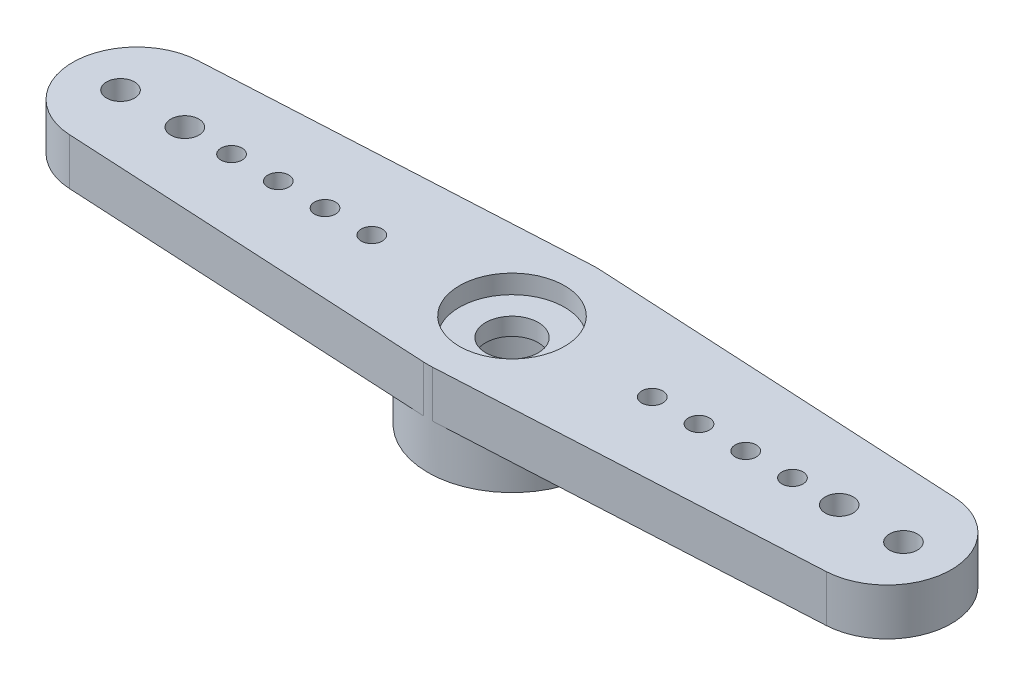
ISO-10303-21;
HEADER;
FILE_DESCRIPTION(('STEP AP214'),'2;1');
FILE_NAME('part.step','',(''),(''),'','','');
FILE_SCHEMA(('AUTOMOTIVE_DESIGN { 1 0 10303 214 1 1 1 1 }'));
ENDSEC;
DATA;
#1=APPLICATION_CONTEXT('core data for automotive mechanical design processes');
#2=APPLICATION_PROTOCOL_DEFINITION('international standard','automotive_design',2000,#1);
#3=PRODUCT_CONTEXT('',#1,'mechanical');
#4=PRODUCT('Part','Part','',(#3));
#5=PRODUCT_RELATED_PRODUCT_CATEGORY('part','',(#4));
#6=PRODUCT_DEFINITION_FORMATION('','',#4);
#7=PRODUCT_DEFINITION_CONTEXT('part definition',#1,'design');
#8=PRODUCT_DEFINITION('design','',#6,#7);
#9=PRODUCT_DEFINITION_SHAPE('','',#8);
#10=(LENGTH_UNIT() NAMED_UNIT(*) SI_UNIT(.MILLI.,.METRE.));
#11=(NAMED_UNIT(*) PLANE_ANGLE_UNIT() SI_UNIT($,.RADIAN.));
#12=(NAMED_UNIT(*) SI_UNIT($,.STERADIAN.) SOLID_ANGLE_UNIT());
#13=UNCERTAINTY_MEASURE_WITH_UNIT(LENGTH_MEASURE(1.E-05),#10,'distance_accuracy_value','');
#14=(GEOMETRIC_REPRESENTATION_CONTEXT(3) GLOBAL_UNCERTAINTY_ASSIGNED_CONTEXT((#13)) GLOBAL_UNIT_ASSIGNED_CONTEXT((#10,
#11,#12)) REPRESENTATION_CONTEXT('',''));
#15=CARTESIAN_POINT('',(0.,0.,0.));
#16=DIRECTION('',(0.,0.,1.));
#17=DIRECTION('',(1.,0.,0.));
#18=AXIS2_PLACEMENT_3D('',#15,#16,#17);
#19=CARTESIAN_POINT('',(0.,55.,0.));
#20=DIRECTION('',(0.,1.,0.));
#21=DIRECTION('',(0.,0.,1.));
#22=AXIS2_PLACEMENT_3D('',#19,#20,#21);
#23=CYLINDRICAL_SURFACE('',#22,3.6);
#24=CARTESIAN_POINT('',(0.,-2.,0.));
#25=DIRECTION('',(0.,1.,0.));
#26=DIRECTION('',(0.,0.,1.));
#27=AXIS2_PLACEMENT_3D('',#24,#25,#26);
#28=CIRCLE('',#27,3.6);
#29=CARTESIAN_POINT('',(0.,-2.,3.6));
#30=VERTEX_POINT('',#29);
#31=EDGE_CURVE('E122',#30,#30,#28,.T.);
#32=ORIENTED_EDGE('',*,*,#31,.T.);
#33=EDGE_LOOP('',(#32));
#34=FACE_BOUND('',#33,.T.);
#35=CARTESIAN_POINT('',(0.,0.,0.));
#36=DIRECTION('',(0.,1.,0.));
#37=DIRECTION('',(0.,0.,1.));
#38=AXIS2_PLACEMENT_3D('',#35,#36,#37);
#39=CIRCLE('',#38,3.6);
#40=CARTESIAN_POINT('',(0.190654205607477,0.,3.59494797930154));
#41=VERTEX_POINT('',#40);
#42=CARTESIAN_POINT('',(0.190654205607477,0.,-3.59494797930153));
#43=VERTEX_POINT('',#42);
#44=EDGE_CURVE('E11',#41,#43,#39,.T.);
#45=ORIENTED_EDGE('',*,*,#44,.F.);
#46=DIRECTION('',(0.,-1.,0.));
#47=VECTOR('',#46,1.);
#48=CARTESIAN_POINT('',(0.190654205607477,40.2831555648173,3.59494797930154));
#49=LINE('',#48,#47);
#50=CARTESIAN_POINT('',(0.190654205607477,2.,3.59494797930154));
#51=VERTEX_POINT('',#50);
#52=EDGE_CURVE('E164',#51,#41,#49,.T.);
#53=ORIENTED_EDGE('',*,*,#52,.F.);
#54=CARTESIAN_POINT('',(0.,2.,0.));
#55=DIRECTION('',(0.,1.,0.));
#56=DIRECTION('',(0.,0.,1.));
#57=AXIS2_PLACEMENT_3D('',#54,#55,#56);
#58=CIRCLE('',#57,3.6);
#59=CARTESIAN_POINT('',(-0.190654205607477,2.,3.59494797930153));
#60=VERTEX_POINT('',#59);
#61=EDGE_CURVE('E123',#60,#51,#58,.T.);
#62=ORIENTED_EDGE('',*,*,#61,.F.);
#63=DIRECTION('',(0.,-1.,0.));
#64=VECTOR('',#63,1.);
#65=CARTESIAN_POINT('',(-0.190654205607478,40.2831555648173,3.59494797930153));
#66=LINE('',#65,#64);
#67=CARTESIAN_POINT('',(-0.190654205607478,0.,3.59494797930153));
#68=VERTEX_POINT('',#67);
#69=EDGE_CURVE('E49',#60,#68,#66,.T.);
#70=ORIENTED_EDGE('',*,*,#69,.T.);
#71=CARTESIAN_POINT('',(-0.190654205607477,0.,-3.59494797930153));
#72=VERTEX_POINT('',#71);
#73=EDGE_CURVE('E42',#72,#68,#39,.T.);
#74=ORIENTED_EDGE('',*,*,#73,.F.);
#75=DIRECTION('',(0.,-1.,0.));
#76=VECTOR('',#75,1.);
#77=CARTESIAN_POINT('',(-0.190654205607477,40.2831555648173,-3.59494797930153));
#78=LINE('',#77,#76);
#79=CARTESIAN_POINT('',(-0.190654205607477,2.,-3.59494797930153));
#80=VERTEX_POINT('',#79);
#81=EDGE_CURVE('E105',#80,#72,#78,.T.);
#82=ORIENTED_EDGE('',*,*,#81,.F.);
#83=CARTESIAN_POINT('',(0.190654205607477,2.,-3.59494797930153));
#84=VERTEX_POINT('',#83);
#85=EDGE_CURVE('E116',#84,#80,#58,.T.);
#86=ORIENTED_EDGE('',*,*,#85,.F.);
#87=DIRECTION('',(0.,-1.,0.));
#88=VECTOR('',#87,1.);
#89=CARTESIAN_POINT('',(0.190654205607477,40.2831555648173,-3.59494797930153));
#90=LINE('',#89,#88);
#91=EDGE_CURVE('E57',#84,#43,#90,.T.);
#92=ORIENTED_EDGE('',*,*,#91,.T.);
#93=EDGE_LOOP('',(#45,#53,#62,#70,#74,#82,#86,#92));
#94=FACE_BOUND('',#93,.T.);
#95=ADVANCED_FACE('F34',(#34,#94),#23,.T.);
#96=CARTESIAN_POINT('',(3.6,2.,0.));
#97=DIRECTION('',(0.,-1.,0.));
#98=DIRECTION('',(0.,0.,-1.));
#99=AXIS2_PLACEMENT_3D('',#96,#97,#98);
#100=PLANE('',#99);
#101=CARTESIAN_POINT('',(0.,2.,0.));
#102=DIRECTION('',(0.,1.,0.));
#103=DIRECTION('',(0.,0.,1.));
#104=AXIS2_PLACEMENT_3D('',#101,#102,#103);
#105=CIRCLE('',#104,2.25);
#106=CARTESIAN_POINT('',(0.,2.,2.25));
#107=VERTEX_POINT('',#106);
#108=EDGE_CURVE('E146',#107,#107,#105,.T.);
#109=ORIENTED_EDGE('',*,*,#108,.F.);
#110=EDGE_LOOP('',(#109));
#111=FACE_BOUND('',#110,.T.);
#112=ORIENTED_EDGE('',*,*,#61,.T.);
#113=DIRECTION('',(-0.998596660917093,0.,0.0529595015576324));
#114=VECTOR('',#113,1.);
#115=CARTESIAN_POINT('',(0.190654205607477,2.,3.59494797930154));
#116=LINE('',#115,#114);
#117=CARTESIAN_POINT('',(16.1956386292835,2.,2.74614081752201));
#118=VERTEX_POINT('',#117);
#119=EDGE_CURVE('E162',#118,#51,#116,.T.);
#120=ORIENTED_EDGE('',*,*,#119,.F.);
#121=CARTESIAN_POINT('',(16.05,2.,0.));
#122=DIRECTION('',(0.,-1.,0.));
#123=DIRECTION('',(0.,0.,-1.));
#124=AXIS2_PLACEMENT_3D('',#121,#122,#123);
#125=CIRCLE('',#124,2.75);
#126=CARTESIAN_POINT('',(16.1956386292835,2.,-2.74614081752201));
#127=VERTEX_POINT('',#126);
#128=EDGE_CURVE('E174',#127,#118,#125,.T.);
#129=ORIENTED_EDGE('',*,*,#128,.F.);
#130=DIRECTION('',(0.998596660917093,0.,0.0529595015576324));
#131=VECTOR('',#130,1.);
#132=CARTESIAN_POINT('',(16.1956386292835,2.,-2.74614081752201));
#133=LINE('',#132,#131);
#134=EDGE_CURVE('E121',#84,#127,#133,.T.);
#135=ORIENTED_EDGE('',*,*,#134,.F.);
#136=ORIENTED_EDGE('',*,*,#85,.T.);
#137=DIRECTION('',(0.998596660917093,0.,-0.0529595015576324));
#138=VECTOR('',#137,1.);
#139=CARTESIAN_POINT('',(-0.190654205607477,2.,-3.59494797930153));
#140=LINE('',#139,#138);
#141=CARTESIAN_POINT('',(-16.1956386292835,2.,-2.74614081752201));
#142=VERTEX_POINT('',#141);
#143=EDGE_CURVE('E101',#142,#80,#140,.T.);
#144=ORIENTED_EDGE('',*,*,#143,.F.);
#145=CARTESIAN_POINT('',(-16.05,2.,0.));
#146=DIRECTION('',(0.,-1.,0.));
#147=DIRECTION('',(0.,0.,-1.));
#148=AXIS2_PLACEMENT_3D('',#145,#146,#147);
#149=CIRCLE('',#148,2.75);
#150=CARTESIAN_POINT('',(-16.1956386292835,2.,2.74614081752201));
#151=VERTEX_POINT('',#150);
#152=EDGE_CURVE('E180',#151,#142,#149,.T.);
#153=ORIENTED_EDGE('',*,*,#152,.F.);
#154=DIRECTION('',(-0.998596660917093,0.,-0.0529595015576324));
#155=VECTOR('',#154,1.);
#156=CARTESIAN_POINT('',(-16.1956386292835,2.,2.74614081752201));
#157=LINE('',#156,#155);
#158=EDGE_CURVE('E182',#60,#151,#157,.T.);
#159=ORIENTED_EDGE('',*,*,#158,.F.);
#160=EDGE_LOOP('',(#112,#120,#129,#135,#136,#144,#153,#159));
#161=FACE_BOUND('',#160,.T.);
#162=CARTESIAN_POINT('',(-16.75,2.,0.));
#163=DIRECTION('',(0.,-1.,0.));
#164=DIRECTION('',(0.,0.,-1.));
#165=AXIS2_PLACEMENT_3D('',#162,#163,#164);
#166=CIRCLE('',#165,0.6);
#167=CARTESIAN_POINT('',(-16.75,2.,-0.6));
#168=VERTEX_POINT('',#167);
#169=EDGE_CURVE('E128',#168,#168,#166,.T.);
#170=ORIENTED_EDGE('',*,*,#169,.T.);
#171=EDGE_LOOP('',(#170));
#172=FACE_BOUND('',#171,.T.);
#173=CARTESIAN_POINT('',(-14.,2.,0.));
#174=DIRECTION('',(0.,-1.,0.));
#175=DIRECTION('',(0.,0.,-1.));
#176=AXIS2_PLACEMENT_3D('',#173,#174,#175);
#177=CIRCLE('',#176,0.6);
#178=CARTESIAN_POINT('',(-14.,2.,-0.6));
#179=VERTEX_POINT('',#178);
#180=EDGE_CURVE('E190',#179,#179,#177,.T.);
#181=ORIENTED_EDGE('',*,*,#180,.T.);
#182=EDGE_LOOP('',(#181));
#183=FACE_BOUND('',#182,.T.);
#184=CARTESIAN_POINT('',(-12.,2.,0.));
#185=DIRECTION('',(0.,-1.,0.));
#186=DIRECTION('',(0.,0.,-1.));
#187=AXIS2_PLACEMENT_3D('',#184,#185,#186);
#188=CIRCLE('',#187,0.45);
#189=CARTESIAN_POINT('',(-12.,2.,-0.45));
#190=VERTEX_POINT('',#189);
#191=EDGE_CURVE('E196',#190,#190,#188,.T.);
#192=ORIENTED_EDGE('',*,*,#191,.T.);
#193=EDGE_LOOP('',(#192));
#194=FACE_BOUND('',#193,.T.);
#195=CARTESIAN_POINT('',(-10.,2.,0.));
#196=DIRECTION('',(0.,-1.,0.));
#197=DIRECTION('',(0.,0.,-1.));
#198=AXIS2_PLACEMENT_3D('',#195,#196,#197);
#199=CIRCLE('',#198,0.45);
#200=CARTESIAN_POINT('',(-10.,2.,-0.45));
#201=VERTEX_POINT('',#200);
#202=EDGE_CURVE('E199',#201,#201,#199,.T.);
#203=ORIENTED_EDGE('',*,*,#202,.T.);
#204=EDGE_LOOP('',(#203));
#205=FACE_BOUND('',#204,.T.);
#206=CARTESIAN_POINT('',(-8.,2.,0.));
#207=DIRECTION('',(0.,-1.,0.));
#208=DIRECTION('',(0.,0.,-1.));
#209=AXIS2_PLACEMENT_3D('',#206,#207,#208);
#210=CIRCLE('',#209,0.45);
#211=CARTESIAN_POINT('',(-8.,2.,-0.45));
#212=VERTEX_POINT('',#211);
#213=EDGE_CURVE('E202',#212,#212,#210,.T.);
#214=ORIENTED_EDGE('',*,*,#213,.T.);
#215=EDGE_LOOP('',(#214));
#216=FACE_BOUND('',#215,.T.);
#217=CARTESIAN_POINT('',(-6.,2.,0.));
#218=DIRECTION('',(0.,-1.,0.));
#219=DIRECTION('',(0.,0.,-1.));
#220=AXIS2_PLACEMENT_3D('',#217,#218,#219);
#221=CIRCLE('',#220,0.45);
#222=CARTESIAN_POINT('',(-6.,2.,-0.45));
#223=VERTEX_POINT('',#222);
#224=EDGE_CURVE('E205',#223,#223,#221,.T.);
#225=ORIENTED_EDGE('',*,*,#224,.T.);
#226=EDGE_LOOP('',(#225));
#227=FACE_BOUND('',#226,.T.);
#228=CARTESIAN_POINT('',(16.75,2.,0.));
#229=DIRECTION('',(0.,-1.,0.));
#230=DIRECTION('',(0.,0.,-1.));
#231=AXIS2_PLACEMENT_3D('',#228,#229,#230);
#232=CIRCLE('',#231,0.6);
#233=CARTESIAN_POINT('',(16.75,2.,-0.6));
#234=VERTEX_POINT('',#233);
#235=EDGE_CURVE('E187',#234,#234,#232,.T.);
#236=ORIENTED_EDGE('',*,*,#235,.T.);
#237=EDGE_LOOP('',(#236));
#238=FACE_BOUND('',#237,.T.);
#239=CARTESIAN_POINT('',(14.,2.,0.));
#240=DIRECTION('',(0.,-1.,0.));
#241=DIRECTION('',(0.,0.,-1.));
#242=AXIS2_PLACEMENT_3D('',#239,#240,#241);
#243=CIRCLE('',#242,0.6);
#244=CARTESIAN_POINT('',(14.,2.,-0.6));
#245=VERTEX_POINT('',#244);
#246=EDGE_CURVE('E193',#245,#245,#243,.T.);
#247=ORIENTED_EDGE('',*,*,#246,.T.);
#248=EDGE_LOOP('',(#247));
#249=FACE_BOUND('',#248,.T.);
#250=CARTESIAN_POINT('',(6.,2.,0.));
#251=DIRECTION('',(0.,-1.,0.));
#252=DIRECTION('',(0.,0.,-1.));
#253=AXIS2_PLACEMENT_3D('',#250,#251,#252);
#254=CIRCLE('',#253,0.45);
#255=CARTESIAN_POINT('',(6.,2.,-0.45));
#256=VERTEX_POINT('',#255);
#257=EDGE_CURVE('E208',#256,#256,#254,.T.);
#258=ORIENTED_EDGE('',*,*,#257,.T.);
#259=EDGE_LOOP('',(#258));
#260=FACE_BOUND('',#259,.T.);
#261=CARTESIAN_POINT('',(8.,2.,0.));
#262=DIRECTION('',(0.,-1.,0.));
#263=DIRECTION('',(0.,0.,-1.));
#264=AXIS2_PLACEMENT_3D('',#261,#262,#263);
#265=CIRCLE('',#264,0.45);
#266=CARTESIAN_POINT('',(8.,2.,-0.45));
#267=VERTEX_POINT('',#266);
#268=EDGE_CURVE('E211',#267,#267,#265,.T.);
#269=ORIENTED_EDGE('',*,*,#268,.T.);
#270=EDGE_LOOP('',(#269));
#271=FACE_BOUND('',#270,.T.);
#272=CARTESIAN_POINT('',(10.,2.,0.));
#273=DIRECTION('',(0.,-1.,0.));
#274=DIRECTION('',(0.,0.,-1.));
#275=AXIS2_PLACEMENT_3D('',#272,#273,#274);
#276=CIRCLE('',#275,0.45);
#277=CARTESIAN_POINT('',(10.,2.,-0.45));
#278=VERTEX_POINT('',#277);
#279=EDGE_CURVE('E213',#278,#278,#276,.T.);
#280=ORIENTED_EDGE('',*,*,#279,.T.);
#281=EDGE_LOOP('',(#280));
#282=FACE_BOUND('',#281,.T.);
#283=CARTESIAN_POINT('',(12.,2.,0.));
#284=DIRECTION('',(0.,-1.,0.));
#285=DIRECTION('',(0.,0.,-1.));
#286=AXIS2_PLACEMENT_3D('',#283,#284,#285);
#287=CIRCLE('',#286,0.45);
#288=CARTESIAN_POINT('',(12.,2.,-0.45));
#289=VERTEX_POINT('',#288);
#290=EDGE_CURVE('E130',#289,#289,#287,.T.);
#291=ORIENTED_EDGE('',*,*,#290,.T.);
#292=EDGE_LOOP('',(#291));
#293=FACE_BOUND('',#292,.T.);
#294=ADVANCED_FACE('F36',(#111,#161,#172,#183,#194,#205,#216,#227,#238,#249,#260,#271,#282,
#293),#100,.F.);
#295=CARTESIAN_POINT('',(0.,55.,0.));
#296=DIRECTION('',(0.,1.,0.));
#297=DIRECTION('',(0.,0.,1.));
#298=AXIS2_PLACEMENT_3D('',#295,#296,#297);
#299=CYLINDRICAL_SURFACE('',#298,2.25);
#300=CARTESIAN_POINT('',(0.,1.2,0.));
#301=DIRECTION('',(0.,1.,0.));
#302=DIRECTION('',(0.,0.,1.));
#303=AXIS2_PLACEMENT_3D('',#300,#301,#302);
#304=CIRCLE('',#303,2.25);
#305=CARTESIAN_POINT('',(0.,1.2,2.25));
#306=VERTEX_POINT('',#305);
#307=EDGE_CURVE('E144',#306,#306,#304,.T.);
#308=ORIENTED_EDGE('',*,*,#307,.F.);
#309=EDGE_LOOP('',(#308));
#310=FACE_BOUND('',#309,.T.);
#311=ORIENTED_EDGE('',*,*,#108,.T.);
#312=EDGE_LOOP('',(#311));
#313=FACE_BOUND('',#312,.T.);
#314=ADVANCED_FACE('F295',(#310,#313),#299,.F.);
#315=CARTESIAN_POINT('',(2.25,1.2,0.));
#316=DIRECTION('',(0.,-1.,0.));
#317=DIRECTION('',(0.,0.,-1.));
#318=AXIS2_PLACEMENT_3D('',#315,#316,#317);
#319=PLANE('',#318);
#320=CARTESIAN_POINT('',(0.,1.2,0.));
#321=DIRECTION('',(0.,1.,0.));
#322=DIRECTION('',(0.,0.,1.));
#323=AXIS2_PLACEMENT_3D('',#320,#321,#322);
#324=CIRCLE('',#323,1.125);
#325=CARTESIAN_POINT('',(0.,1.2,1.125));
#326=VERTEX_POINT('',#325);
#327=EDGE_CURVE('E141',#326,#326,#324,.T.);
#328=ORIENTED_EDGE('',*,*,#327,.F.);
#329=EDGE_LOOP('',(#328));
#330=FACE_BOUND('',#329,.T.);
#331=ORIENTED_EDGE('',*,*,#307,.T.);
#332=EDGE_LOOP('',(#331));
#333=FACE_BOUND('',#332,.T.);
#334=ADVANCED_FACE('F316',(#330,#333),#319,.F.);
#335=CARTESIAN_POINT('',(0.,55.,0.));
#336=DIRECTION('',(0.,1.,0.));
#337=DIRECTION('',(0.,0.,1.));
#338=AXIS2_PLACEMENT_3D('',#335,#336,#337);
#339=CYLINDRICAL_SURFACE('',#338,1.125);
#340=CARTESIAN_POINT('',(0.,0.449999999999999,0.));
#341=DIRECTION('',(0.,1.,0.));
#342=DIRECTION('',(0.,0.,1.));
#343=AXIS2_PLACEMENT_3D('',#340,#341,#342);
#344=CIRCLE('',#343,1.125);
#345=CARTESIAN_POINT('',(0.,0.449999999999999,1.125));
#346=VERTEX_POINT('',#345);
#347=EDGE_CURVE('E138',#346,#346,#344,.T.);
#348=ORIENTED_EDGE('',*,*,#347,.F.);
#349=EDGE_LOOP('',(#348));
#350=FACE_BOUND('',#349,.T.);
#351=ORIENTED_EDGE('',*,*,#327,.T.);
#352=EDGE_LOOP('',(#351));
#353=FACE_BOUND('',#352,.T.);
#354=ADVANCED_FACE('F312',(#350,#353),#339,.F.);
#355=CARTESIAN_POINT('',(1.125,0.45,0.));
#356=DIRECTION('',(0.,1.,0.));
#357=DIRECTION('',(0.,0.,1.));
#358=AXIS2_PLACEMENT_3D('',#355,#356,#357);
#359=PLANE('',#358);
#360=CARTESIAN_POINT('',(0.,0.449999999999999,0.));
#361=DIRECTION('',(0.,1.,0.));
#362=DIRECTION('',(0.,0.,1.));
#363=AXIS2_PLACEMENT_3D('',#360,#361,#362);
#364=CIRCLE('',#363,2.425);
#365=CARTESIAN_POINT('',(0.,0.449999999999999,2.425));
#366=VERTEX_POINT('',#365);
#367=EDGE_CURVE('E135',#366,#366,#364,.T.);
#368=ORIENTED_EDGE('',*,*,#367,.F.);
#369=EDGE_LOOP('',(#368));
#370=FACE_BOUND('',#369,.T.);
#371=ORIENTED_EDGE('',*,*,#347,.T.);
#372=EDGE_LOOP('',(#371));
#373=FACE_BOUND('',#372,.T.);
#374=ADVANCED_FACE('F308',(#370,#373),#359,.F.);
#375=CARTESIAN_POINT('',(0.,55.,0.));
#376=DIRECTION('',(0.,1.,0.));
#377=DIRECTION('',(0.,0.,1.));
#378=AXIS2_PLACEMENT_3D('',#375,#376,#377);
#379=CYLINDRICAL_SURFACE('',#378,2.425);
#380=ORIENTED_EDGE('',*,*,#367,.T.);
#381=EDGE_LOOP('',(#380));
#382=FACE_BOUND('',#381,.T.);
#383=CARTESIAN_POINT('',(0.,-2.,0.));
#384=DIRECTION('',(0.,1.,0.));
#385=DIRECTION('',(0.,0.,1.));
#386=AXIS2_PLACEMENT_3D('',#383,#384,#385);
#387=CIRCLE('',#386,2.425);
#388=CARTESIAN_POINT('',(0.,-2.,2.425));
#389=VERTEX_POINT('',#388);
#390=EDGE_CURVE('E126',#389,#389,#387,.T.);
#391=ORIENTED_EDGE('',*,*,#390,.F.);
#392=EDGE_LOOP('',(#391));
#393=FACE_BOUND('',#392,.T.);
#394=ADVANCED_FACE('F304',(#382,#393),#379,.F.);
#395=CARTESIAN_POINT('',(2.425,-2.,0.));
#396=DIRECTION('',(0.,1.,0.));
#397=DIRECTION('',(0.,0.,1.));
#398=AXIS2_PLACEMENT_3D('',#395,#396,#397);
#399=PLANE('',#398);
#400=ORIENTED_EDGE('',*,*,#31,.F.);
#401=EDGE_LOOP('',(#400));
#402=FACE_BOUND('',#401,.T.);
#403=ORIENTED_EDGE('',*,*,#390,.T.);
#404=EDGE_LOOP('',(#403));
#405=FACE_BOUND('',#404,.T.);
#406=ADVANCED_FACE('F301',(#402,#405),#399,.F.);
#407=CARTESIAN_POINT('',(-16.05,40.2831555648173,0.));
#408=DIRECTION('',(0.,-1.,0.));
#409=DIRECTION('',(0.,0.,-1.));
#410=AXIS2_PLACEMENT_3D('',#407,#408,#409);
#411=CYLINDRICAL_SURFACE('',#410,2.75);
#412=DIRECTION('',(0.,-1.,0.));
#413=VECTOR('',#412,1.);
#414=CARTESIAN_POINT('',(-16.1956386292835,40.2831555648173,2.74614081752201));
#415=LINE('',#414,#413);
#416=CARTESIAN_POINT('',(-16.1956386292835,0.,2.74614081752201));
#417=VERTEX_POINT('',#416);
#418=EDGE_CURVE('E157',#151,#417,#415,.T.);
#419=ORIENTED_EDGE('',*,*,#418,.F.);
#420=ORIENTED_EDGE('',*,*,#152,.T.);
#421=DIRECTION('',(0.,-1.,0.));
#422=VECTOR('',#421,1.);
#423=CARTESIAN_POINT('',(-16.1956386292835,40.2831555648173,-2.74614081752201));
#424=LINE('',#423,#422);
#425=CARTESIAN_POINT('',(-16.1956386292835,0.,-2.74614081752201));
#426=VERTEX_POINT('',#425);
#427=EDGE_CURVE('E107',#142,#426,#424,.T.);
#428=ORIENTED_EDGE('',*,*,#427,.T.);
#429=CARTESIAN_POINT('',(-16.05,0.,0.));
#430=DIRECTION('',(0.,1.,0.));
#431=DIRECTION('',(0.,0.,1.));
#432=AXIS2_PLACEMENT_3D('',#429,#430,#431);
#433=CIRCLE('',#432,2.75);
#434=EDGE_CURVE('E183',#426,#417,#433,.T.);
#435=ORIENTED_EDGE('',*,*,#434,.T.);
#436=EDGE_LOOP('',(#419,#420,#428,#435));
#437=FACE_BOUND('',#436,.T.);
#438=ADVANCED_FACE('F270',(#437),#411,.T.);
#439=CARTESIAN_POINT('',(-6.,40.2831555648173,0.));
#440=DIRECTION('',(0.,-1.,0.));
#441=DIRECTION('',(0.,0.,-1.));
#442=AXIS2_PLACEMENT_3D('',#439,#440,#441);
#443=CYLINDRICAL_SURFACE('',#442,0.45);
#444=ORIENTED_EDGE('',*,*,#224,.F.);
#445=EDGE_LOOP('',(#444));
#446=FACE_BOUND('',#445,.T.);
#447=CARTESIAN_POINT('',(-6.,0.,0.));
#448=DIRECTION('',(0.,1.,0.));
#449=DIRECTION('',(0.,0.,1.));
#450=AXIS2_PLACEMENT_3D('',#447,#448,#449);
#451=CIRCLE('',#450,0.45);
#452=CARTESIAN_POINT('',(-6.,0.,0.45));
#453=VERTEX_POINT('',#452);
#454=EDGE_CURVE('E252',#453,#453,#451,.T.);
#455=ORIENTED_EDGE('',*,*,#454,.F.);
#456=EDGE_LOOP('',(#455));
#457=FACE_BOUND('',#456,.T.);
#458=ADVANCED_FACE('F354',(#446,#457),#443,.F.);
#459=CARTESIAN_POINT('',(-8.,40.2831555648173,0.));
#460=DIRECTION('',(0.,-1.,0.));
#461=DIRECTION('',(0.,0.,-1.));
#462=AXIS2_PLACEMENT_3D('',#459,#460,#461);
#463=CYLINDRICAL_SURFACE('',#462,0.45);
#464=ORIENTED_EDGE('',*,*,#213,.F.);
#465=EDGE_LOOP('',(#464));
#466=FACE_BOUND('',#465,.T.);
#467=CARTESIAN_POINT('',(-8.,0.,0.));
#468=DIRECTION('',(0.,1.,0.));
#469=DIRECTION('',(0.,0.,1.));
#470=AXIS2_PLACEMENT_3D('',#467,#468,#469);
#471=CIRCLE('',#470,0.45);
#472=CARTESIAN_POINT('',(-8.,0.,0.45));
#473=VERTEX_POINT('',#472);
#474=EDGE_CURVE('E249',#473,#473,#471,.T.);
#475=ORIENTED_EDGE('',*,*,#474,.F.);
#476=EDGE_LOOP('',(#475));
#477=FACE_BOUND('',#476,.T.);
#478=ADVANCED_FACE('F361',(#466,#477),#463,.F.);
#479=CARTESIAN_POINT('',(-10.,40.2831555648173,0.));
#480=DIRECTION('',(0.,-1.,0.));
#481=DIRECTION('',(0.,0.,-1.));
#482=AXIS2_PLACEMENT_3D('',#479,#480,#481);
#483=CYLINDRICAL_SURFACE('',#482,0.45);
#484=ORIENTED_EDGE('',*,*,#202,.F.);
#485=EDGE_LOOP('',(#484));
#486=FACE_BOUND('',#485,.T.);
#487=CARTESIAN_POINT('',(-10.,0.,0.));
#488=DIRECTION('',(0.,1.,0.));
#489=DIRECTION('',(0.,0.,1.));
#490=AXIS2_PLACEMENT_3D('',#487,#488,#489);
#491=CIRCLE('',#490,0.45);
#492=CARTESIAN_POINT('',(-10.,0.,0.45));
#493=VERTEX_POINT('',#492);
#494=EDGE_CURVE('E246',#493,#493,#491,.T.);
#495=ORIENTED_EDGE('',*,*,#494,.F.);
#496=EDGE_LOOP('',(#495));
#497=FACE_BOUND('',#496,.T.);
#498=ADVANCED_FACE('F369',(#486,#497),#483,.F.);
#499=CARTESIAN_POINT('',(-12.,40.2831555648173,0.));
#500=DIRECTION('',(0.,-1.,0.));
#501=DIRECTION('',(0.,0.,-1.));
#502=AXIS2_PLACEMENT_3D('',#499,#500,#501);
#503=CYLINDRICAL_SURFACE('',#502,0.45);
#504=ORIENTED_EDGE('',*,*,#191,.F.);
#505=EDGE_LOOP('',(#504));
#506=FACE_BOUND('',#505,.T.);
#507=CARTESIAN_POINT('',(-12.,0.,0.));
#508=DIRECTION('',(0.,1.,0.));
#509=DIRECTION('',(0.,0.,1.));
#510=AXIS2_PLACEMENT_3D('',#507,#508,#509);
#511=CIRCLE('',#510,0.45);
#512=CARTESIAN_POINT('',(-12.,0.,0.45));
#513=VERTEX_POINT('',#512);
#514=EDGE_CURVE('E243',#513,#513,#511,.T.);
#515=ORIENTED_EDGE('',*,*,#514,.F.);
#516=EDGE_LOOP('',(#515));
#517=FACE_BOUND('',#516,.T.);
#518=ADVANCED_FACE('F377',(#506,#517),#503,.F.);
#519=CARTESIAN_POINT('',(-14.,40.2831555648173,0.));
#520=DIRECTION('',(0.,-1.,0.));
#521=DIRECTION('',(0.,0.,-1.));
#522=AXIS2_PLACEMENT_3D('',#519,#520,#521);
#523=CYLINDRICAL_SURFACE('',#522,0.6);
#524=ORIENTED_EDGE('',*,*,#180,.F.);
#525=EDGE_LOOP('',(#524));
#526=FACE_BOUND('',#525,.T.);
#527=CARTESIAN_POINT('',(-14.,0.,0.));
#528=DIRECTION('',(0.,1.,0.));
#529=DIRECTION('',(0.,0.,1.));
#530=AXIS2_PLACEMENT_3D('',#527,#528,#529);
#531=CIRCLE('',#530,0.6);
#532=CARTESIAN_POINT('',(-14.,0.,0.6));
#533=VERTEX_POINT('',#532);
#534=EDGE_CURVE('E236',#533,#533,#531,.T.);
#535=ORIENTED_EDGE('',*,*,#534,.F.);
#536=EDGE_LOOP('',(#535));
#537=FACE_BOUND('',#536,.T.);
#538=ADVANCED_FACE('F385',(#526,#537),#523,.F.);
#539=CARTESIAN_POINT('',(-16.75,40.2831555648173,0.));
#540=DIRECTION('',(0.,-1.,0.));
#541=DIRECTION('',(0.,0.,-1.));
#542=AXIS2_PLACEMENT_3D('',#539,#540,#541);
#543=CYLINDRICAL_SURFACE('',#542,0.6);
#544=ORIENTED_EDGE('',*,*,#169,.F.);
#545=EDGE_LOOP('',(#544));
#546=FACE_BOUND('',#545,.T.);
#547=CARTESIAN_POINT('',(-16.75,0.,0.));
#548=DIRECTION('',(0.,1.,0.));
#549=DIRECTION('',(0.,0.,1.));
#550=AXIS2_PLACEMENT_3D('',#547,#548,#549);
#551=CIRCLE('',#550,0.6);
#552=CARTESIAN_POINT('',(-16.75,0.,0.6));
#553=VERTEX_POINT('',#552);
#554=EDGE_CURVE('E233',#553,#553,#551,.T.);
#555=ORIENTED_EDGE('',*,*,#554,.F.);
#556=EDGE_LOOP('',(#555));
#557=FACE_BOUND('',#556,.T.);
#558=ADVANCED_FACE('F393',(#546,#557),#543,.F.);
#559=CARTESIAN_POINT('',(-16.1956386292835,40.2831555648173,2.74614081752201));
#560=DIRECTION('',(0.0529595015576324,0.,-0.998596660917093));
#561=DIRECTION('',(-0.998596660917093,0.,-0.0529595015576324));
#562=AXIS2_PLACEMENT_3D('',#559,#560,#561);
#563=PLANE('',#562);
#564=ORIENTED_EDGE('',*,*,#69,.F.);
#565=ORIENTED_EDGE('',*,*,#158,.T.);
#566=ORIENTED_EDGE('',*,*,#418,.T.);
#567=DIRECTION('',(0.998596660917093,0.,0.0529595015576324));
#568=VECTOR('',#567,1.);
#569=CARTESIAN_POINT('',(-16.1956386292835,0.,2.74614081752201));
#570=LINE('',#569,#568);
#571=EDGE_CURVE('E154',#417,#68,#570,.T.);
#572=ORIENTED_EDGE('',*,*,#571,.T.);
#573=EDGE_LOOP('',(#564,#565,#566,#572));
#574=FACE_BOUND('',#573,.T.);
#575=ADVANCED_FACE('F155',(#574),#563,.F.);
#576=CARTESIAN_POINT('',(-0.190654205607477,40.2831555648173,-3.59494797930153));
#577=DIRECTION('',(0.0529595015576324,0.,0.998596660917093));
#578=DIRECTION('',(0.998596660917093,0.,-0.0529595015576324));
#579=AXIS2_PLACEMENT_3D('',#576,#577,#578);
#580=PLANE('',#579);
#581=ORIENTED_EDGE('',*,*,#427,.F.);
#582=ORIENTED_EDGE('',*,*,#143,.T.);
#583=ORIENTED_EDGE('',*,*,#81,.T.);
#584=DIRECTION('',(-0.998596660917093,0.,0.0529595015576324));
#585=VECTOR('',#584,1.);
#586=CARTESIAN_POINT('',(-0.190654205607477,0.,-3.59494797930153));
#587=LINE('',#586,#585);
#588=EDGE_CURVE('E117',#72,#426,#587,.T.);
#589=ORIENTED_EDGE('',*,*,#588,.T.);
#590=EDGE_LOOP('',(#581,#582,#583,#589));
#591=FACE_BOUND('',#590,.T.);
#592=ADVANCED_FACE('F103',(#591),#580,.F.);
#593=CARTESIAN_POINT('',(16.05,0.,0.));
#594=DIRECTION('',(0.,1.,0.));
#595=DIRECTION('',(0.,0.,1.));
#596=AXIS2_PLACEMENT_3D('',#593,#594,#595);
#597=PLANE('',#596);
#598=ORIENTED_EDGE('',*,*,#474,.T.);
#599=EDGE_LOOP('',(#598));
#600=FACE_BOUND('',#599,.T.);
#601=ORIENTED_EDGE('',*,*,#514,.T.);
#602=EDGE_LOOP('',(#601));
#603=FACE_BOUND('',#602,.T.);
#604=ORIENTED_EDGE('',*,*,#534,.T.);
#605=EDGE_LOOP('',(#604));
#606=FACE_BOUND('',#605,.T.);
#607=ORIENTED_EDGE('',*,*,#554,.T.);
#608=EDGE_LOOP('',(#607));
#609=FACE_BOUND('',#608,.T.);
#610=ORIENTED_EDGE('',*,*,#494,.T.);
#611=EDGE_LOOP('',(#610));
#612=FACE_BOUND('',#611,.T.);
#613=ORIENTED_EDGE('',*,*,#454,.T.);
#614=EDGE_LOOP('',(#613));
#615=FACE_BOUND('',#614,.T.);
#616=ORIENTED_EDGE('',*,*,#588,.F.);
#617=ORIENTED_EDGE('',*,*,#73,.T.);
#618=ORIENTED_EDGE('',*,*,#571,.F.);
#619=ORIENTED_EDGE('',*,*,#434,.F.);
#620=EDGE_LOOP('',(#616,#617,#618,#619));
#621=FACE_BOUND('',#620,.T.);
#622=ADVANCED_FACE('F152',(#600,#603,#606,#609,#612,#615,#621),#597,.F.);
#623=CARTESIAN_POINT('',(10.,0.,0.));
#624=DIRECTION('',(0.,1.,0.));
#625=DIRECTION('',(0.,0.,1.));
#626=AXIS2_PLACEMENT_3D('',#623,#624,#625);
#627=CIRCLE('',#626,0.45);
#628=CARTESIAN_POINT('',(10.,0.,0.45));
#629=VERTEX_POINT('',#628);
#630=EDGE_CURVE('E177',#629,#629,#627,.T.);
#631=ORIENTED_EDGE('',*,*,#630,.T.);
#632=EDGE_LOOP('',(#631));
#633=FACE_BOUND('',#632,.T.);
#634=CARTESIAN_POINT('',(6.,0.,0.));
#635=DIRECTION('',(0.,1.,0.));
#636=DIRECTION('',(0.,0.,1.));
#637=AXIS2_PLACEMENT_3D('',#634,#635,#636);
#638=CIRCLE('',#637,0.45);
#639=CARTESIAN_POINT('',(6.,0.,0.45));
#640=VERTEX_POINT('',#639);
#641=EDGE_CURVE('E255',#640,#640,#638,.T.);
#642=ORIENTED_EDGE('',*,*,#641,.T.);
#643=EDGE_LOOP('',(#642));
#644=FACE_BOUND('',#643,.T.);
#645=CARTESIAN_POINT('',(16.75,0.,0.));
#646=DIRECTION('',(0.,1.,0.));
#647=DIRECTION('',(0.,0.,1.));
#648=AXIS2_PLACEMENT_3D('',#645,#646,#647);
#649=CIRCLE('',#648,0.6);
#650=CARTESIAN_POINT('',(16.75,0.,0.6));
#651=VERTEX_POINT('',#650);
#652=EDGE_CURVE('E237',#651,#651,#649,.T.);
#653=ORIENTED_EDGE('',*,*,#652,.T.);
#654=EDGE_LOOP('',(#653));
#655=FACE_BOUND('',#654,.T.);
#656=CARTESIAN_POINT('',(14.,0.,0.));
#657=DIRECTION('',(0.,1.,0.));
#658=DIRECTION('',(0.,0.,1.));
#659=AXIS2_PLACEMENT_3D('',#656,#657,#658);
#660=CIRCLE('',#659,0.6);
#661=CARTESIAN_POINT('',(14.,0.,0.6));
#662=VERTEX_POINT('',#661);
#663=EDGE_CURVE('E240',#662,#662,#660,.T.);
#664=ORIENTED_EDGE('',*,*,#663,.T.);
#665=EDGE_LOOP('',(#664));
#666=FACE_BOUND('',#665,.T.);
#667=CARTESIAN_POINT('',(8.,0.,0.));
#668=DIRECTION('',(0.,1.,0.));
#669=DIRECTION('',(0.,0.,1.));
#670=AXIS2_PLACEMENT_3D('',#667,#668,#669);
#671=CIRCLE('',#670,0.45);
#672=CARTESIAN_POINT('',(8.,0.,0.45));
#673=VERTEX_POINT('',#672);
#674=EDGE_CURVE('E258',#673,#673,#671,.T.);
#675=ORIENTED_EDGE('',*,*,#674,.T.);
#676=EDGE_LOOP('',(#675));
#677=FACE_BOUND('',#676,.T.);
#678=CARTESIAN_POINT('',(12.,0.,0.));
#679=DIRECTION('',(0.,1.,0.));
#680=DIRECTION('',(0.,0.,1.));
#681=AXIS2_PLACEMENT_3D('',#678,#679,#680);
#682=CIRCLE('',#681,0.45);
#683=CARTESIAN_POINT('',(12.,0.,0.45));
#684=VERTEX_POINT('',#683);
#685=EDGE_CURVE('E263',#684,#684,#682,.T.);
#686=ORIENTED_EDGE('',*,*,#685,.T.);
#687=EDGE_LOOP('',(#686));
#688=FACE_BOUND('',#687,.T.);
#689=DIRECTION('',(0.998596660917093,0.,-0.0529595015576324));
#690=VECTOR('',#689,1.);
#691=CARTESIAN_POINT('',(0.190654205607477,0.,3.59494797930154));
#692=LINE('',#691,#690);
#693=CARTESIAN_POINT('',(16.1956386292835,0.,2.74614081752201));
#694=VERTEX_POINT('',#693);
#695=EDGE_CURVE('E170',#41,#694,#692,.T.);
#696=ORIENTED_EDGE('',*,*,#695,.F.);
#697=ORIENTED_EDGE('',*,*,#44,.T.);
#698=DIRECTION('',(-0.998596660917093,0.,-0.0529595015576324));
#699=VECTOR('',#698,1.);
#700=CARTESIAN_POINT('',(16.1956386292835,0.,-2.74614081752201));
#701=LINE('',#700,#699);
#702=CARTESIAN_POINT('',(16.1956386292835,0.,-2.74614081752201));
#703=VERTEX_POINT('',#702);
#704=EDGE_CURVE('E229',#703,#43,#701,.T.);
#705=ORIENTED_EDGE('',*,*,#704,.F.);
#706=CARTESIAN_POINT('',(16.05,0.,0.));
#707=DIRECTION('',(0.,1.,0.));
#708=DIRECTION('',(0.,0.,1.));
#709=AXIS2_PLACEMENT_3D('',#706,#707,#708);
#710=CIRCLE('',#709,2.75);
#711=EDGE_CURVE('E173',#694,#703,#710,.T.);
#712=ORIENTED_EDGE('',*,*,#711,.F.);
#713=EDGE_LOOP('',(#696,#697,#705,#712));
#714=FACE_BOUND('',#713,.T.);
#715=ADVANCED_FACE('F418',(#633,#644,#655,#666,#677,#688,#714),#597,.F.);
#716=CARTESIAN_POINT('',(16.05,40.2831555648173,0.));
#717=DIRECTION('',(0.,-1.,0.));
#718=DIRECTION('',(0.,0.,-1.));
#719=AXIS2_PLACEMENT_3D('',#716,#717,#718);
#720=CYLINDRICAL_SURFACE('',#719,2.75);
#721=DIRECTION('',(0.,-1.,0.));
#722=VECTOR('',#721,1.);
#723=CARTESIAN_POINT('',(16.1956386292835,40.2831555648173,-2.74614081752201));
#724=LINE('',#723,#722);
#725=EDGE_CURVE('E178',#127,#703,#724,.T.);
#726=ORIENTED_EDGE('',*,*,#725,.F.);
#727=ORIENTED_EDGE('',*,*,#128,.T.);
#728=DIRECTION('',(0.,-1.,0.));
#729=VECTOR('',#728,1.);
#730=CARTESIAN_POINT('',(16.1956386292835,40.2831555648173,2.74614081752201));
#731=LINE('',#730,#729);
#732=EDGE_CURVE('E171',#118,#694,#731,.T.);
#733=ORIENTED_EDGE('',*,*,#732,.T.);
#734=ORIENTED_EDGE('',*,*,#711,.T.);
#735=EDGE_LOOP('',(#726,#727,#733,#734));
#736=FACE_BOUND('',#735,.T.);
#737=ADVANCED_FACE('F273',(#736),#720,.T.);
#738=CARTESIAN_POINT('',(16.1956386292835,40.2831555648173,-2.74614081752201));
#739=DIRECTION('',(-0.0529595015576324,0.,0.998596660917093));
#740=DIRECTION('',(0.998596660917093,0.,0.0529595015576324));
#741=AXIS2_PLACEMENT_3D('',#738,#739,#740);
#742=PLANE('',#741);
#743=ORIENTED_EDGE('',*,*,#91,.F.);
#744=ORIENTED_EDGE('',*,*,#134,.T.);
#745=ORIENTED_EDGE('',*,*,#725,.T.);
#746=ORIENTED_EDGE('',*,*,#704,.T.);
#747=EDGE_LOOP('',(#743,#744,#745,#746));
#748=FACE_BOUND('',#747,.T.);
#749=ADVANCED_FACE('F277',(#748),#742,.F.);
#750=CARTESIAN_POINT('',(0.190654205607477,40.2831555648173,3.59494797930154));
#751=DIRECTION('',(-0.0529595015576324,0.,-0.998596660917093));
#752=DIRECTION('',(-0.998596660917093,0.,0.0529595015576324));
#753=AXIS2_PLACEMENT_3D('',#750,#751,#752);
#754=PLANE('',#753);
#755=ORIENTED_EDGE('',*,*,#732,.F.);
#756=ORIENTED_EDGE('',*,*,#119,.T.);
#757=ORIENTED_EDGE('',*,*,#52,.T.);
#758=ORIENTED_EDGE('',*,*,#695,.T.);
#759=EDGE_LOOP('',(#755,#756,#757,#758));
#760=FACE_BOUND('',#759,.T.);
#761=ADVANCED_FACE('F274',(#760),#754,.F.);
#762=CARTESIAN_POINT('',(16.75,40.2831555648173,0.));
#763=DIRECTION('',(0.,-1.,0.));
#764=DIRECTION('',(0.,0.,-1.));
#765=AXIS2_PLACEMENT_3D('',#762,#763,#764);
#766=CYLINDRICAL_SURFACE('',#765,0.6);
#767=ORIENTED_EDGE('',*,*,#235,.F.);
#768=EDGE_LOOP('',(#767));
#769=FACE_BOUND('',#768,.T.);
#770=ORIENTED_EDGE('',*,*,#652,.F.);
#771=EDGE_LOOP('',(#770));
#772=FACE_BOUND('',#771,.T.);
#773=ADVANCED_FACE('F276',(#769,#772),#766,.F.);
#774=CARTESIAN_POINT('',(14.,40.2831555648173,0.));
#775=DIRECTION('',(0.,-1.,0.));
#776=DIRECTION('',(0.,0.,-1.));
#777=AXIS2_PLACEMENT_3D('',#774,#775,#776);
#778=CYLINDRICAL_SURFACE('',#777,0.6);
#779=ORIENTED_EDGE('',*,*,#246,.F.);
#780=EDGE_LOOP('',(#779));
#781=FACE_BOUND('',#780,.T.);
#782=ORIENTED_EDGE('',*,*,#663,.F.);
#783=EDGE_LOOP('',(#782));
#784=FACE_BOUND('',#783,.T.);
#785=ADVANCED_FACE('F283',(#781,#784),#778,.F.);
#786=CARTESIAN_POINT('',(6.,40.2831555648173,0.));
#787=DIRECTION('',(0.,-1.,0.));
#788=DIRECTION('',(0.,0.,-1.));
#789=AXIS2_PLACEMENT_3D('',#786,#787,#788);
#790=CYLINDRICAL_SURFACE('',#789,0.45);
#791=ORIENTED_EDGE('',*,*,#257,.F.);
#792=EDGE_LOOP('',(#791));
#793=FACE_BOUND('',#792,.T.);
#794=ORIENTED_EDGE('',*,*,#641,.F.);
#795=EDGE_LOOP('',(#794));
#796=FACE_BOUND('',#795,.T.);
#797=ADVANCED_FACE('F455',(#793,#796),#790,.F.);
#798=CARTESIAN_POINT('',(8.,40.2831555648173,0.));
#799=DIRECTION('',(0.,-1.,0.));
#800=DIRECTION('',(0.,0.,-1.));
#801=AXIS2_PLACEMENT_3D('',#798,#799,#800);
#802=CYLINDRICAL_SURFACE('',#801,0.45);
#803=ORIENTED_EDGE('',*,*,#268,.F.);
#804=EDGE_LOOP('',(#803));
#805=FACE_BOUND('',#804,.T.);
#806=ORIENTED_EDGE('',*,*,#674,.F.);
#807=EDGE_LOOP('',(#806));
#808=FACE_BOUND('',#807,.T.);
#809=ADVANCED_FACE('F465',(#805,#808),#802,.F.);
#810=CARTESIAN_POINT('',(10.,40.2831555648173,0.));
#811=DIRECTION('',(0.,-1.,0.));
#812=DIRECTION('',(0.,0.,-1.));
#813=AXIS2_PLACEMENT_3D('',#810,#811,#812);
#814=CYLINDRICAL_SURFACE('',#813,0.45);
#815=ORIENTED_EDGE('',*,*,#279,.F.);
#816=EDGE_LOOP('',(#815));
#817=FACE_BOUND('',#816,.T.);
#818=ORIENTED_EDGE('',*,*,#630,.F.);
#819=EDGE_LOOP('',(#818));
#820=FACE_BOUND('',#819,.T.);
#821=ADVANCED_FACE('F475',(#817,#820),#814,.F.);
#822=CARTESIAN_POINT('',(12.,40.2831555648173,0.));
#823=DIRECTION('',(0.,-1.,0.));
#824=DIRECTION('',(0.,0.,-1.));
#825=AXIS2_PLACEMENT_3D('',#822,#823,#824);
#826=CYLINDRICAL_SURFACE('',#825,0.45);
#827=ORIENTED_EDGE('',*,*,#290,.F.);
#828=EDGE_LOOP('',(#827));
#829=FACE_BOUND('',#828,.T.);
#830=ORIENTED_EDGE('',*,*,#685,.F.);
#831=EDGE_LOOP('',(#830));
#832=FACE_BOUND('',#831,.T.);
#833=ADVANCED_FACE('F299',(#829,#832),#826,.F.);
#834=CLOSED_SHELL('',(#95,#294,#314,#334,#354,#374,#394,#406,#438,#458,#478,#498,#518,#538,#558,
#575,#592,#622,#715,#737,#749,#761,#773,#785,#797,#809,#821,#833));
#835=MANIFOLD_SOLID_BREP('B2',#834);
#836=ADVANCED_BREP_SHAPE_REPRESENTATION('',(#18,#835),#14);
#837=SHAPE_DEFINITION_REPRESENTATION(#9,#836);
ENDSEC;
END-ISO-10303-21;
